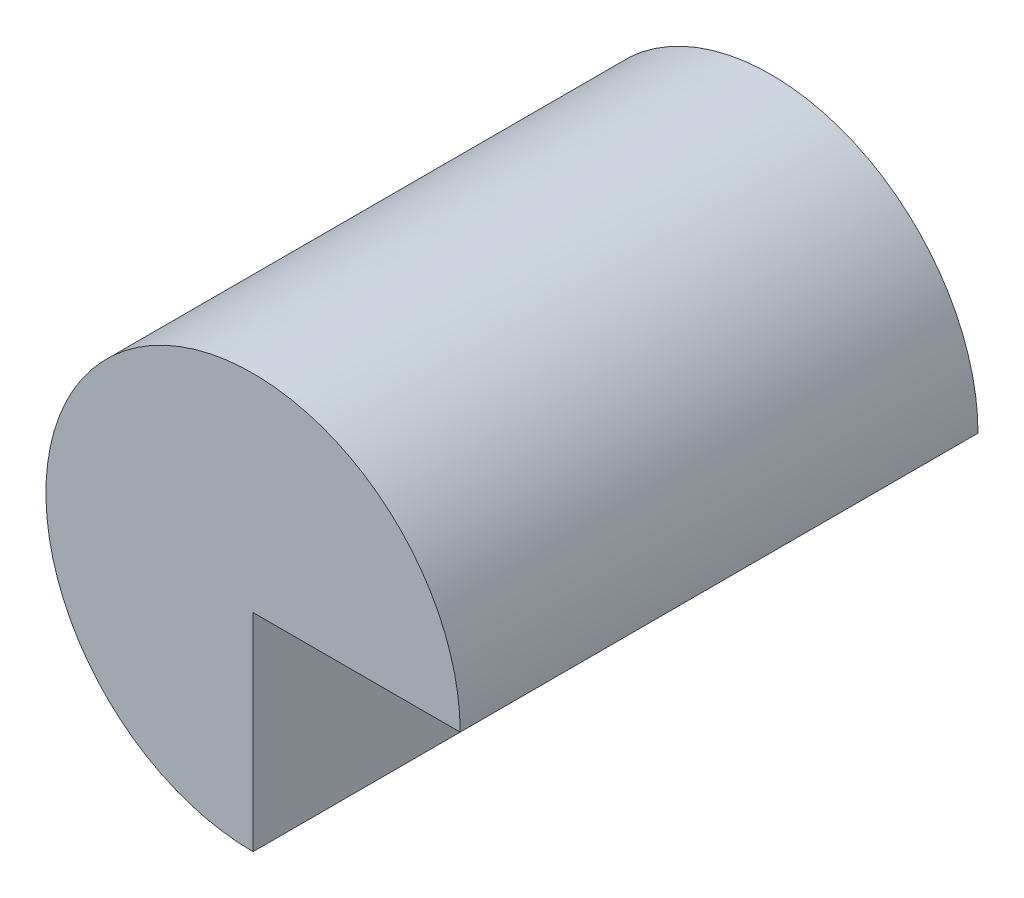
ISO-10303-21;
HEADER;
FILE_DESCRIPTION(('STEP AP214'),'2;1');
FILE_NAME('part.step','',(''),(''),'','','');
FILE_SCHEMA(('AUTOMOTIVE_DESIGN { 1 0 10303 214 1 1 1 1 }'));
ENDSEC;
DATA;
#1=APPLICATION_CONTEXT('core data for automotive mechanical design processes');
#2=APPLICATION_PROTOCOL_DEFINITION('international standard','automotive_design',2000,#1);
#3=PRODUCT_CONTEXT('',#1,'mechanical');
#4=PRODUCT('Part','Part','',(#3));
#5=PRODUCT_RELATED_PRODUCT_CATEGORY('part','',(#4));
#6=PRODUCT_DEFINITION_FORMATION('','',#4);
#7=PRODUCT_DEFINITION_CONTEXT('part definition',#1,'design');
#8=PRODUCT_DEFINITION('design','',#6,#7);
#9=PRODUCT_DEFINITION_SHAPE('','',#8);
#10=(LENGTH_UNIT() NAMED_UNIT(*) SI_UNIT(.MILLI.,.METRE.));
#11=(NAMED_UNIT(*) PLANE_ANGLE_UNIT() SI_UNIT($,.RADIAN.));
#12=(NAMED_UNIT(*) SI_UNIT($,.STERADIAN.) SOLID_ANGLE_UNIT());
#13=UNCERTAINTY_MEASURE_WITH_UNIT(LENGTH_MEASURE(1.E-05),#10,'distance_accuracy_value','');
#14=(GEOMETRIC_REPRESENTATION_CONTEXT(3) GLOBAL_UNCERTAINTY_ASSIGNED_CONTEXT((#13)) GLOBAL_UNIT_ASSIGNED_CONTEXT((#10,
#11,#12)) REPRESENTATION_CONTEXT('',''));
#15=CARTESIAN_POINT('',(0.,0.,0.));
#16=DIRECTION('',(0.,0.,1.));
#17=DIRECTION('',(1.,0.,0.));
#18=AXIS2_PLACEMENT_3D('',#15,#16,#17);
#19=CARTESIAN_POINT('',(-10.,0.,25.));
#20=DIRECTION('',(0.,0.,-1.));
#21=DIRECTION('',(-1.,0.,0.));
#22=AXIS2_PLACEMENT_3D('',#19,#20,#21);
#23=CYLINDRICAL_SURFACE('',#22,10.);
#24=CARTESIAN_POINT('',(-10.,0.,0.));
#25=DIRECTION('',(0.,0.,1.));
#26=DIRECTION('',(-1.,0.,0.));
#27=AXIS2_PLACEMENT_3D('',#24,#25,#26);
#28=CIRCLE('',#27,10.);
#29=CARTESIAN_POINT('',(0.,0.,0.));
#30=VERTEX_POINT('',#29);
#31=CARTESIAN_POINT('',(-10.,-10.,0.));
#32=VERTEX_POINT('',#31);
#33=EDGE_CURVE('E80',#30,#32,#28,.T.);
#34=ORIENTED_EDGE('',*,*,#33,.T.);
#35=DIRECTION('',(0.,0.,-1.));
#36=VECTOR('',#35,1.);
#37=CARTESIAN_POINT('',(-10.,-10.,25.));
#38=LINE('',#37,#36);
#39=CARTESIAN_POINT('',(-10.,-10.,25.));
#40=VERTEX_POINT('',#39);
#41=EDGE_CURVE('E11',#40,#32,#38,.T.);
#42=ORIENTED_EDGE('',*,*,#41,.F.);
#43=CARTESIAN_POINT('',(-10.,0.,25.));
#44=DIRECTION('',(0.,0.,1.));
#45=DIRECTION('',(-1.,0.,0.));
#46=AXIS2_PLACEMENT_3D('',#43,#44,#45);
#47=CIRCLE('',#46,10.);
#48=CARTESIAN_POINT('',(0.,0.,25.));
#49=VERTEX_POINT('',#48);
#50=EDGE_CURVE('E73',#49,#40,#47,.T.);
#51=ORIENTED_EDGE('',*,*,#50,.F.);
#52=DIRECTION('',(0.,0.,-1.));
#53=VECTOR('',#52,1.);
#54=CARTESIAN_POINT('',(0.,0.,25.));
#55=LINE('',#54,#53);
#56=EDGE_CURVE('E81',#49,#30,#55,.T.);
#57=ORIENTED_EDGE('',*,*,#56,.T.);
#58=EDGE_LOOP('',(#34,#42,#51,#57));
#59=FACE_BOUND('',#58,.T.);
#60=ADVANCED_FACE('F33',(#59),#23,.T.);
#61=CARTESIAN_POINT('',(-10.,-10.,25.));
#62=DIRECTION('',(-1.,0.,0.));
#63=DIRECTION('',(0.,0.,1.));
#64=AXIS2_PLACEMENT_3D('',#61,#62,#63);
#65=PLANE('',#64);
#66=DIRECTION('',(0.,1.,0.));
#67=VECTOR('',#66,1.);
#68=CARTESIAN_POINT('',(-10.,-10.,0.));
#69=LINE('',#68,#67);
#70=CARTESIAN_POINT('',(-10.,0.,0.));
#71=VERTEX_POINT('',#70);
#72=EDGE_CURVE('E61',#32,#71,#69,.T.);
#73=ORIENTED_EDGE('',*,*,#72,.T.);
#74=DIRECTION('',(0.,0.,-1.));
#75=VECTOR('',#74,1.);
#76=CARTESIAN_POINT('',(-10.,0.,25.));
#77=LINE('',#76,#75);
#78=CARTESIAN_POINT('',(-10.,0.,25.));
#79=VERTEX_POINT('',#78);
#80=EDGE_CURVE('E41',#79,#71,#77,.T.);
#81=ORIENTED_EDGE('',*,*,#80,.F.);
#82=DIRECTION('',(0.,1.,0.));
#83=VECTOR('',#82,1.);
#84=CARTESIAN_POINT('',(-10.,-10.,25.));
#85=LINE('',#84,#83);
#86=EDGE_CURVE('E69',#40,#79,#85,.T.);
#87=ORIENTED_EDGE('',*,*,#86,.F.);
#88=ORIENTED_EDGE('',*,*,#41,.T.);
#89=EDGE_LOOP('',(#73,#81,#87,#88));
#90=FACE_BOUND('',#89,.T.);
#91=ADVANCED_FACE('F70',(#90),#65,.F.);
#92=CARTESIAN_POINT('',(-10.,0.,25.));
#93=DIRECTION('',(0.,1.,0.));
#94=DIRECTION('',(0.,0.,1.));
#95=AXIS2_PLACEMENT_3D('',#92,#93,#94);
#96=PLANE('',#95);
#97=DIRECTION('',(1.,0.,0.));
#98=VECTOR('',#97,1.);
#99=CARTESIAN_POINT('',(-10.,0.,0.));
#100=LINE('',#99,#98);
#101=EDGE_CURVE('E66',#71,#30,#100,.T.);
#102=ORIENTED_EDGE('',*,*,#101,.T.);
#103=ORIENTED_EDGE('',*,*,#56,.F.);
#104=DIRECTION('',(1.,0.,0.));
#105=VECTOR('',#104,1.);
#106=CARTESIAN_POINT('',(-10.,0.,25.));
#107=LINE('',#106,#105);
#108=EDGE_CURVE('E49',#79,#49,#107,.T.);
#109=ORIENTED_EDGE('',*,*,#108,.F.);
#110=ORIENTED_EDGE('',*,*,#80,.T.);
#111=EDGE_LOOP('',(#102,#103,#109,#110));
#112=FACE_BOUND('',#111,.T.);
#113=ADVANCED_FACE('F88',(#112),#96,.F.);
#114=CARTESIAN_POINT('',(-10.,0.,25.));
#115=DIRECTION('',(0.,0.,-1.));
#116=DIRECTION('',(-1.,0.,0.));
#117=AXIS2_PLACEMENT_3D('',#114,#115,#116);
#118=PLANE('',#117);
#119=ORIENTED_EDGE('',*,*,#50,.T.);
#120=ORIENTED_EDGE('',*,*,#86,.T.);
#121=ORIENTED_EDGE('',*,*,#108,.T.);
#122=EDGE_LOOP('',(#119,#120,#121));
#123=FACE_BOUND('',#122,.T.);
#124=ADVANCED_FACE('F76',(#123),#118,.F.);
#125=CARTESIAN_POINT('',(-10.,0.,0.));
#126=DIRECTION('',(0.,0.,-1.));
#127=DIRECTION('',(-1.,0.,0.));
#128=AXIS2_PLACEMENT_3D('',#125,#126,#127);
#129=PLANE('',#128);
#130=ORIENTED_EDGE('',*,*,#33,.F.);
#131=ORIENTED_EDGE('',*,*,#101,.F.);
#132=ORIENTED_EDGE('',*,*,#72,.F.);
#133=EDGE_LOOP('',(#130,#131,#132));
#134=FACE_BOUND('',#133,.T.);
#135=ADVANCED_FACE('F89',(#134),#129,.T.);
#136=CLOSED_SHELL('',(#60,#91,#113,#124,#135));
#137=MANIFOLD_SOLID_BREP('B2',#136);
#138=ADVANCED_BREP_SHAPE_REPRESENTATION('',(#18,#137),#14);
#139=SHAPE_DEFINITION_REPRESENTATION(#9,#138);
ENDSEC;
END-ISO-10303-21;
